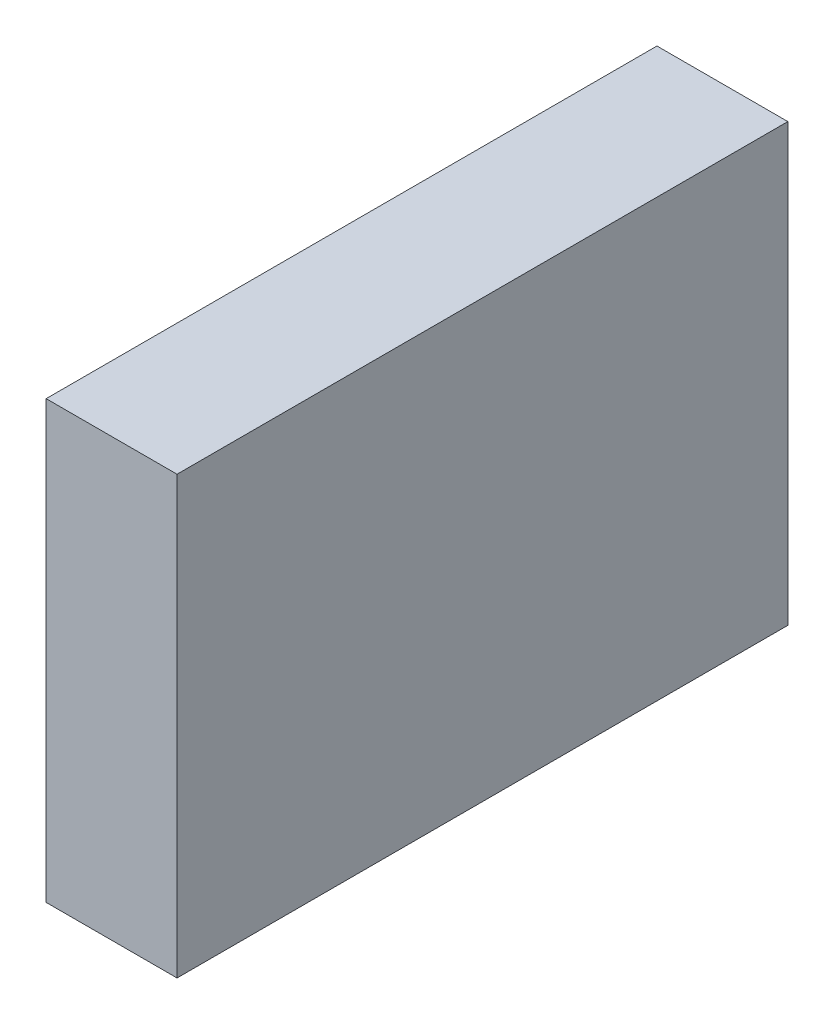
ISO-10303-21;
HEADER;
FILE_DESCRIPTION(('STEP AP214'),'2;1');
FILE_NAME('part.step','',(''),(''),'','','');
FILE_SCHEMA(('AUTOMOTIVE_DESIGN { 1 0 10303 214 1 1 1 1 }'));
ENDSEC;
DATA;
#1=APPLICATION_CONTEXT('core data for automotive mechanical design processes');
#2=APPLICATION_PROTOCOL_DEFINITION('international standard','automotive_design',2000,#1);
#3=PRODUCT_CONTEXT('',#1,'mechanical');
#4=PRODUCT('Part','Part','',(#3));
#5=PRODUCT_RELATED_PRODUCT_CATEGORY('part','',(#4));
#6=PRODUCT_DEFINITION_FORMATION('','',#4);
#7=PRODUCT_DEFINITION_CONTEXT('part definition',#1,'design');
#8=PRODUCT_DEFINITION('design','',#6,#7);
#9=PRODUCT_DEFINITION_SHAPE('','',#8);
#10=(LENGTH_UNIT() NAMED_UNIT(*) SI_UNIT(.MILLI.,.METRE.));
#11=(NAMED_UNIT(*) PLANE_ANGLE_UNIT() SI_UNIT($,.RADIAN.));
#12=(NAMED_UNIT(*) SI_UNIT($,.STERADIAN.) SOLID_ANGLE_UNIT());
#13=UNCERTAINTY_MEASURE_WITH_UNIT(LENGTH_MEASURE(1.E-05),#10,'distance_accuracy_value','');
#14=(GEOMETRIC_REPRESENTATION_CONTEXT(3) GLOBAL_UNCERTAINTY_ASSIGNED_CONTEXT((#13)) GLOBAL_UNIT_ASSIGNED_CONTEXT((#10,
#11,#12)) REPRESENTATION_CONTEXT('',''));
#15=CARTESIAN_POINT('',(0.,0.,0.));
#16=DIRECTION('',(0.,0.,1.));
#17=DIRECTION('',(1.,0.,0.));
#18=AXIS2_PLACEMENT_3D('',#15,#16,#17);
#19=CARTESIAN_POINT('',(-3.00000031821889,-1.8199992979951,-3.72112136188666));
#20=DIRECTION('',(1.,-1.74845553146952E-07,0.));
#21=DIRECTION('',(1.74845553146952E-07,1.,-8.74227765734759E-08));
#22=AXIS2_PLACEMENT_3D('',#19,#20,#21);
#23=PLANE('',#22);
#24=DIRECTION('',(0.,8.74227765576152E-08,0.999999999999996));
#25=VECTOR('',#24,1.);
#26=CARTESIAN_POINT('',(-3.00000013113415,-0.749999291873509,-3.65112145542903));
#27=LINE('',#26,#25);
#28=CARTESIAN_POINT('',(-3.00000013113415,-0.74999929187351,-3.65112145542803));
#29=VERTEX_POINT('',#28);
#30=CARTESIAN_POINT('',(-3.00000013113414,-0.749999169482623,-2.25112145542903));
#31=VERTEX_POINT('',#30);
#32=EDGE_CURVE('E11',#29,#31,#27,.T.);
#33=ORIENTED_EDGE('',*,*,#32,.T.);
#34=DIRECTION('',(-1.74845553146599E-07,-0.999999999999981,8.74227765732994E-08));
#35=VECTOR('',#34,1.);
#36=CARTESIAN_POINT('',(-3.00000013113414,-0.749999169481623,-2.25112145542903));
#37=LINE('',#36,#35);
#38=CARTESIAN_POINT('',(-3.00000030597969,-1.74999916948362,-2.25112136800726));
#39=VERTEX_POINT('',#38);
#40=EDGE_CURVE('E69',#31,#39,#37,.T.);
#41=ORIENTED_EDGE('',*,*,#40,.T.);
#42=DIRECTION('',(0.,-8.74227764783136E-08,-0.999999999999996));
#43=VECTOR('',#42,1.);
#44=CARTESIAN_POINT('',(-3.00000030597969,-1.74999916948362,-2.25112136800626));
#45=LINE('',#44,#43);
#46=CARTESIAN_POINT('',(-3.0000003059797,-1.74999929187451,-3.65112136800626));
#47=VERTEX_POINT('',#46);
#48=EDGE_CURVE('E55',#39,#47,#45,.T.);
#49=ORIENTED_EDGE('',*,*,#48,.T.);
#50=DIRECTION('',(1.74845553146599E-07,0.999999999999981,-8.74227765732993E-08));
#51=VECTOR('',#50,1.);
#52=CARTESIAN_POINT('',(-3.0000003059797,-1.74999929187551,-3.65112136800626));
#53=LINE('',#52,#51);
#54=EDGE_CURVE('E53',#47,#29,#53,.T.);
#55=ORIENTED_EDGE('',*,*,#54,.T.);
#56=EDGE_LOOP('',(#33,#41,#49,#55));
#57=FACE_BOUND('',#56,.T.);
#58=ADVANCED_FACE('F17',(#57),#23,.T.);
#59=CARTESIAN_POINT('',(-3.30000031821889,-1.81999924554144,-3.72112136188667));
#60=DIRECTION('',(1.,-1.74845553146952E-07,0.));
#61=DIRECTION('',(1.74845553146952E-07,1.,-8.74227765734759E-08));
#62=AXIS2_PLACEMENT_3D('',#59,#60,#61);
#63=PLANE('',#62);
#64=DIRECTION('',(1.74845553146599E-07,0.999999999999981,-8.74227765732993E-08));
#65=VECTOR('',#64,1.);
#66=CARTESIAN_POINT('',(-3.3000003059797,-1.74999923942184,-3.65112136800626));
#67=LINE('',#66,#65);
#68=CARTESIAN_POINT('',(-3.3000003059797,-1.74999923942084,-3.65112136800626));
#69=VERTEX_POINT('',#68);
#70=CARTESIAN_POINT('',(-3.30000013113415,-0.749999239419844,-3.65112145542804));
#71=VERTEX_POINT('',#70);
#72=EDGE_CURVE('E24',#69,#71,#67,.T.);
#73=ORIENTED_EDGE('',*,*,#72,.F.);
#74=DIRECTION('',(0.,-8.74227766369168E-08,-0.999999999999996));
#75=VECTOR('',#74,1.);
#76=CARTESIAN_POINT('',(-3.30000030597969,-1.74999911702996,-2.25112136800626));
#77=LINE('',#76,#75);
#78=CARTESIAN_POINT('',(-3.30000030597969,-1.74999911702996,-2.25112136800726));
#79=VERTEX_POINT('',#78);
#80=EDGE_CURVE('E70',#79,#69,#77,.T.);
#81=ORIENTED_EDGE('',*,*,#80,.F.);
#82=DIRECTION('',(-1.74845553146599E-07,-0.999999999999981,8.74227765732993E-08));
#83=VECTOR('',#82,1.);
#84=CARTESIAN_POINT('',(-3.30000013113414,-0.749999117027957,-2.25112145542904));
#85=LINE('',#84,#83);
#86=CARTESIAN_POINT('',(-3.30000013113414,-0.749999117028957,-2.25112145542904));
#87=VERTEX_POINT('',#86);
#88=EDGE_CURVE('E59',#87,#79,#85,.T.);
#89=ORIENTED_EDGE('',*,*,#88,.F.);
#90=DIRECTION('',(0.,8.74227765576152E-08,0.999999999999996));
#91=VECTOR('',#90,1.);
#92=CARTESIAN_POINT('',(-3.30000013113415,-0.749999239419844,-3.65112145542904));
#93=LINE('',#92,#91);
#94=EDGE_CURVE('E78',#71,#87,#93,.T.);
#95=ORIENTED_EDGE('',*,*,#94,.F.);
#96=EDGE_LOOP('',(#73,#81,#89,#95));
#97=FACE_BOUND('',#96,.T.);
#98=ADVANCED_FACE('F89',(#97),#63,.F.);
#99=CARTESIAN_POINT('',(-3.00000013113415,-0.74999929187351,-3.65112145542903));
#100=DIRECTION('',(-1.74845553146952E-07,-1.,8.74227765734759E-08));
#101=DIRECTION('',(0.,8.74227765734759E-08,1.));
#102=AXIS2_PLACEMENT_3D('',#99,#100,#101);
#103=PLANE('',#102);
#104=DIRECTION('',(-0.999999999999985,1.74845553220964E-07,0.));
#105=VECTOR('',#104,1.);
#106=CARTESIAN_POINT('',(-3.00000013113415,-0.74999929187351,-3.65112145542903));
#107=LINE('',#106,#105);
#108=EDGE_CURVE('E65',#29,#71,#107,.T.);
#109=ORIENTED_EDGE('',*,*,#108,.T.);
#110=ORIENTED_EDGE('',*,*,#94,.T.);
#111=DIRECTION('',(-0.999999999999985,1.74845553220964E-07,0.));
#112=VECTOR('',#111,1.);
#113=CARTESIAN_POINT('',(-3.00000013113414,-0.749999169481623,-2.25112145542903));
#114=LINE('',#113,#112);
#115=EDGE_CURVE('E66',#31,#87,#114,.T.);
#116=ORIENTED_EDGE('',*,*,#115,.F.);
#117=ORIENTED_EDGE('',*,*,#32,.F.);
#118=EDGE_LOOP('',(#109,#110,#116,#117));
#119=FACE_BOUND('',#118,.T.);
#120=ADVANCED_FACE('F63',(#119),#103,.F.);
#121=CARTESIAN_POINT('',(-3.00000013113414,-0.749999169481623,-2.25112145542903));
#122=DIRECTION('',(0.,-8.74227765734759E-08,-1.));
#123=DIRECTION('',(-1.74845553146952E-07,-1.,8.74227765734759E-08));
#124=AXIS2_PLACEMENT_3D('',#121,#122,#123);
#125=PLANE('',#124);
#126=ORIENTED_EDGE('',*,*,#115,.T.);
#127=ORIENTED_EDGE('',*,*,#88,.T.);
#128=DIRECTION('',(-0.999999999999985,1.7484555285089E-07,0.));
#129=VECTOR('',#128,1.);
#130=CARTESIAN_POINT('',(-3.00000030597969,-1.74999916948362,-2.25112136800626));
#131=LINE('',#130,#129);
#132=EDGE_CURVE('E60',#39,#79,#131,.T.);
#133=ORIENTED_EDGE('',*,*,#132,.F.);
#134=ORIENTED_EDGE('',*,*,#40,.F.);
#135=EDGE_LOOP('',(#126,#127,#133,#134));
#136=FACE_BOUND('',#135,.T.);
#137=ADVANCED_FACE('F91',(#136),#125,.F.);
#138=CARTESIAN_POINT('',(-3.00000030597969,-1.74999916948362,-2.25112136800626));
#139=DIRECTION('',(1.74845553146952E-07,1.,-8.74227765734759E-08));
#140=DIRECTION('',(0.,-8.74227765734759E-08,-1.));
#141=AXIS2_PLACEMENT_3D('',#138,#139,#140);
#142=PLANE('',#141);
#143=ORIENTED_EDGE('',*,*,#132,.T.);
#144=ORIENTED_EDGE('',*,*,#80,.T.);
#145=DIRECTION('',(-0.999999999999985,1.7484555285089E-07,0.));
#146=VECTOR('',#145,1.);
#147=CARTESIAN_POINT('',(-3.0000003059797,-1.74999929187551,-3.65112136800626));
#148=LINE('',#147,#146);
#149=EDGE_CURVE('E84',#47,#69,#148,.T.);
#150=ORIENTED_EDGE('',*,*,#149,.F.);
#151=ORIENTED_EDGE('',*,*,#48,.F.);
#152=EDGE_LOOP('',(#143,#144,#150,#151));
#153=FACE_BOUND('',#152,.T.);
#154=ADVANCED_FACE('F86',(#153),#142,.F.);
#155=CARTESIAN_POINT('',(-3.0000003059797,-1.74999929187551,-3.65112136800626));
#156=DIRECTION('',(0.,8.74227765734759E-08,1.));
#157=DIRECTION('',(1.74845553146952E-07,1.,-8.74227765734759E-08));
#158=AXIS2_PLACEMENT_3D('',#155,#156,#157);
#159=PLANE('',#158);
#160=ORIENTED_EDGE('',*,*,#149,.T.);
#161=ORIENTED_EDGE('',*,*,#72,.T.);
#162=ORIENTED_EDGE('',*,*,#108,.F.);
#163=ORIENTED_EDGE('',*,*,#54,.F.);
#164=EDGE_LOOP('',(#160,#161,#162,#163));
#165=FACE_BOUND('',#164,.T.);
#166=ADVANCED_FACE('F68',(#165),#159,.F.);
#167=CLOSED_SHELL('',(#58,#98,#120,#137,#154,#166));
#168=MANIFOLD_SOLID_BREP('B1',#167);
#169=ADVANCED_BREP_SHAPE_REPRESENTATION('',(#18,#168),#14);
#170=SHAPE_DEFINITION_REPRESENTATION(#9,#169);
ENDSEC;
END-ISO-10303-21;
